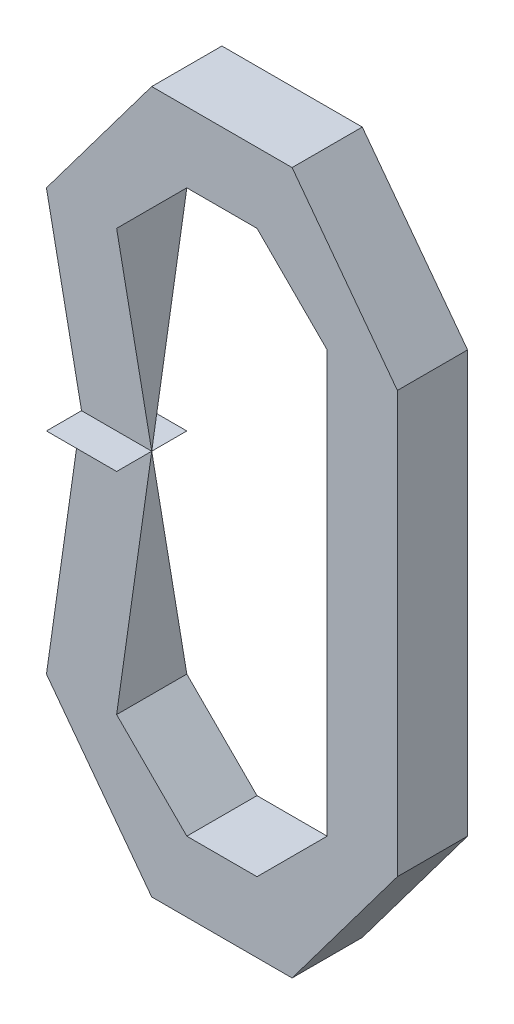
ISO-10303-21;
HEADER;
FILE_DESCRIPTION(('STEP AP214'),'2;1');
FILE_NAME('part.step','',(''),(''),'','','');
FILE_SCHEMA(('AUTOMOTIVE_DESIGN { 1 0 10303 214 1 1 1 1 }'));
ENDSEC;
DATA;
#1=APPLICATION_CONTEXT('core data for automotive mechanical design processes');
#2=APPLICATION_PROTOCOL_DEFINITION('international standard','automotive_design',2000,#1);
#3=PRODUCT_CONTEXT('',#1,'mechanical');
#4=PRODUCT('Part','Part','',(#3));
#5=PRODUCT_RELATED_PRODUCT_CATEGORY('part','',(#4));
#6=PRODUCT_DEFINITION_FORMATION('','',#4);
#7=PRODUCT_DEFINITION_CONTEXT('part definition',#1,'design');
#8=PRODUCT_DEFINITION('design','',#6,#7);
#9=PRODUCT_DEFINITION_SHAPE('','',#8);
#10=(LENGTH_UNIT() NAMED_UNIT(*) SI_UNIT(.MILLI.,.METRE.));
#11=(NAMED_UNIT(*) PLANE_ANGLE_UNIT() SI_UNIT($,.RADIAN.));
#12=(NAMED_UNIT(*) SI_UNIT($,.STERADIAN.) SOLID_ANGLE_UNIT());
#13=UNCERTAINTY_MEASURE_WITH_UNIT(LENGTH_MEASURE(1.E-05),#10,'distance_accuracy_value','');
#14=(GEOMETRIC_REPRESENTATION_CONTEXT(3) GLOBAL_UNCERTAINTY_ASSIGNED_CONTEXT((#13)) GLOBAL_UNIT_ASSIGNED_CONTEXT((#10,
#11,#12)) REPRESENTATION_CONTEXT('',''));
#15=CARTESIAN_POINT('',(0.,0.,0.));
#16=DIRECTION('',(0.,0.,1.));
#17=DIRECTION('',(1.,0.,0.));
#18=AXIS2_PLACEMENT_3D('',#15,#16,#17);
#19=CARTESIAN_POINT('',(-0.0381,0.,0.0254));
#20=DIRECTION('',(0.,0.,1.));
#21=DIRECTION('',(1.,0.,0.));
#22=AXIS2_PLACEMENT_3D('',#19,#20,#21);
#23=PLANE('',#22);
#24=DIRECTION('',(-0.6,-0.8,0.));
#25=VECTOR('',#24,1.);
#26=CARTESIAN_POINT('',(-0.06349999999999,0.0762,0.0254));
#27=LINE('',#26,#25);
#28=CARTESIAN_POINT('',(-0.06349999999999,0.0762,0.0254));
#29=VERTEX_POINT('',#28);
#30=CARTESIAN_POINT('',(-0.02539999999999,0.127,0.0254));
#31=VERTEX_POINT('',#30);
#32=EDGE_CURVE('P0_E215',#29,#31,#27,.F.);
#33=ORIENTED_EDGE('',*,*,#32,.F.);
#34=DIRECTION('',(0.,1.,0.));
#35=VECTOR('',#34,1.);
#36=CARTESIAN_POINT('',(-0.06349999999999,0.,0.0254));
#37=LINE('',#36,#35);
#38=CARTESIAN_POINT('',(-0.06349999999999,0.,0.0127));
#39=VERTEX_POINT('',#38);
#40=EDGE_CURVE('P0_E210',#39,#29,#37,.T.);
#41=ORIENTED_EDGE('',*,*,#40,.F.);
#42=DIRECTION('',(0.,1.,0.));
#43=VECTOR('',#42,1.);
#44=CARTESIAN_POINT('',(-0.06349999999999,-0.0762,0.0254));
#45=LINE('',#44,#43);
#46=CARTESIAN_POINT('',(-0.06349999999999,-0.0762,0.0254));
#47=VERTEX_POINT('',#46);
#48=EDGE_CURVE('P0_E235',#47,#39,#45,.T.);
#49=ORIENTED_EDGE('',*,*,#48,.F.);
#50=DIRECTION('',(0.6,-0.8,0.));
#51=VECTOR('',#50,1.);
#52=CARTESIAN_POINT('',(-0.02539999999999,-0.127,0.0254));
#53=LINE('',#52,#51);
#54=CARTESIAN_POINT('',(-0.02539999999999,-0.127,0.0254));
#55=VERTEX_POINT('',#54);
#56=EDGE_CURVE('P0_E233',#55,#47,#53,.F.);
#57=ORIENTED_EDGE('',*,*,#56,.F.);
#58=DIRECTION('',(1.,0.,0.));
#59=VECTOR('',#58,1.);
#60=CARTESIAN_POINT('',(0.0254,-0.127,0.0254));
#61=LINE('',#60,#59);
#62=CARTESIAN_POINT('',(0.0254,-0.127,0.0254));
#63=VERTEX_POINT('',#62);
#64=EDGE_CURVE('P0_E230',#63,#55,#61,.F.);
#65=ORIENTED_EDGE('',*,*,#64,.F.);
#66=DIRECTION('',(0.6,0.8,0.));
#67=VECTOR('',#66,1.);
#68=CARTESIAN_POINT('',(0.0635,-0.0762,0.0254));
#69=LINE('',#68,#67);
#70=CARTESIAN_POINT('',(0.0635,-0.0762,0.0254));
#71=VERTEX_POINT('',#70);
#72=EDGE_CURVE('P0_E227',#71,#63,#69,.F.);
#73=ORIENTED_EDGE('',*,*,#72,.F.);
#74=DIRECTION('',(0.,1.,0.));
#75=VECTOR('',#74,1.);
#76=CARTESIAN_POINT('',(0.0635,0.0762,0.0254));
#77=LINE('',#76,#75);
#78=CARTESIAN_POINT('',(0.0635,0.0762,0.0254));
#79=VERTEX_POINT('',#78);
#80=EDGE_CURVE('P0_E224',#79,#71,#77,.F.);
#81=ORIENTED_EDGE('',*,*,#80,.F.);
#82=DIRECTION('',(-0.6,0.8,0.));
#83=VECTOR('',#82,1.);
#84=CARTESIAN_POINT('',(0.0254,0.127,0.0254));
#85=LINE('',#84,#83);
#86=CARTESIAN_POINT('',(0.0254,0.127,0.0254));
#87=VERTEX_POINT('',#86);
#88=EDGE_CURVE('P0_E221',#87,#79,#85,.F.);
#89=ORIENTED_EDGE('',*,*,#88,.F.);
#90=DIRECTION('',(1.,0.,0.));
#91=VECTOR('',#90,1.);
#92=CARTESIAN_POINT('',(-0.02539999999999,0.127,0.0254));
#93=LINE('',#92,#91);
#94=EDGE_CURVE('P0_E218',#31,#87,#93,.T.);
#95=ORIENTED_EDGE('',*,*,#94,.F.);
#96=EDGE_LOOP('',(#33,#41,#49,#57,#65,#73,#81,#89,#95));
#97=FACE_BOUND('',#96,.T.);
#98=DIRECTION('',(-0.707106781186548,0.707106781186547,0.));
#99=VECTOR('',#98,1.);
#100=CARTESIAN_POINT('',(-0.0127,-0.1016,0.0254));
#101=LINE('',#100,#99);
#102=CARTESIAN_POINT('',(-0.0127,-0.1016,0.0254));
#103=VERTEX_POINT('',#102);
#104=CARTESIAN_POINT('',(-0.0381,-0.0762,0.0254));
#105=VERTEX_POINT('',#104);
#106=EDGE_CURVE('P0_E244',#103,#105,#101,.T.);
#107=ORIENTED_EDGE('',*,*,#106,.T.);
#108=DIRECTION('',(0.,1.,0.));
#109=VECTOR('',#108,1.);
#110=CARTESIAN_POINT('',(-0.0381,0.,0.0254));
#111=LINE('',#110,#109);
#112=CARTESIAN_POINT('',(-0.0381,0.,0.0127));
#113=VERTEX_POINT('',#112);
#114=EDGE_CURVE('P0_E136',#105,#113,#111,.T.);
#115=ORIENTED_EDGE('',*,*,#114,.T.);
#116=DIRECTION('',(0.,1.,0.));
#117=VECTOR('',#116,1.);
#118=CARTESIAN_POINT('',(-0.0381,0.,0.0254));
#119=LINE('',#118,#117);
#120=CARTESIAN_POINT('',(-0.0381,0.0762,0.0254));
#121=VERTEX_POINT('',#120);
#122=EDGE_CURVE('P0_E134',#113,#121,#119,.T.);
#123=ORIENTED_EDGE('',*,*,#122,.T.);
#124=DIRECTION('',(0.707106781186548,0.707106781186547,0.));
#125=VECTOR('',#124,1.);
#126=CARTESIAN_POINT('',(-0.0381,0.0762,0.0254));
#127=LINE('',#126,#125);
#128=CARTESIAN_POINT('',(-0.0127,0.1016,0.0254));
#129=VERTEX_POINT('',#128);
#130=EDGE_CURVE('P0_E130',#121,#129,#127,.T.);
#131=ORIENTED_EDGE('',*,*,#130,.T.);
#132=DIRECTION('',(1.,0.,0.));
#133=VECTOR('',#132,1.);
#134=CARTESIAN_POINT('',(-0.0381,0.1016,0.0254));
#135=LINE('',#134,#133);
#136=CARTESIAN_POINT('',(0.01270000000001,0.1016,0.0254));
#137=VERTEX_POINT('',#136);
#138=EDGE_CURVE('P0_E259',#129,#137,#135,.T.);
#139=ORIENTED_EDGE('',*,*,#138,.T.);
#140=DIRECTION('',(0.707106781186408,-0.707106781186687,0.));
#141=VECTOR('',#140,1.);
#142=CARTESIAN_POINT('',(0.01270000000001,0.1016,0.0254));
#143=LINE('',#142,#141);
#144=CARTESIAN_POINT('',(0.0381,0.0762,0.0254));
#145=VERTEX_POINT('',#144);
#146=EDGE_CURVE('P0_E256',#137,#145,#143,.T.);
#147=ORIENTED_EDGE('',*,*,#146,.T.);
#148=DIRECTION('',(0.,1.,0.));
#149=VECTOR('',#148,1.);
#150=CARTESIAN_POINT('',(0.0381,0.,0.0254));
#151=LINE('',#150,#149);
#152=CARTESIAN_POINT('',(0.0381,-0.0762,0.0254));
#153=VERTEX_POINT('',#152);
#154=EDGE_CURVE('P0_E253',#145,#153,#151,.F.);
#155=ORIENTED_EDGE('',*,*,#154,.T.);
#156=DIRECTION('',(-0.707106781186408,-0.707106781186687,0.));
#157=VECTOR('',#156,1.);
#158=CARTESIAN_POINT('',(0.0381,-0.0762,0.0254));
#159=LINE('',#158,#157);
#160=CARTESIAN_POINT('',(0.01270000000001,-0.1016,0.0254));
#161=VERTEX_POINT('',#160);
#162=EDGE_CURVE('P0_E250',#153,#161,#159,.T.);
#163=ORIENTED_EDGE('',*,*,#162,.T.);
#164=DIRECTION('',(1.,0.,0.));
#165=VECTOR('',#164,1.);
#166=CARTESIAN_POINT('',(-0.0381,-0.1016,0.0254));
#167=LINE('',#166,#165);
#168=EDGE_CURVE('P0_E247',#161,#103,#167,.F.);
#169=ORIENTED_EDGE('',*,*,#168,.T.);
#170=EDGE_LOOP('',(#107,#115,#123,#131,#139,#147,#155,#163,#169));
#171=FACE_BOUND('',#170,.T.);
#172=ADVANCED_FACE('P0_F17',(#97,#171),#23,.T.);
#173=CARTESIAN_POINT('',(-0.0381,0.,0.));
#174=DIRECTION('',(-1.,0.,0.));
#175=DIRECTION('',(0.,0.,1.));
#176=AXIS2_PLACEMENT_3D('',#173,#174,#175);
#177=PLANE('',#176);
#178=DIRECTION('',(0.,0.,1.));
#179=VECTOR('',#178,1.);
#180=CARTESIAN_POINT('',(-0.0381,0.0762,0.));
#181=LINE('',#180,#179);
#182=CARTESIAN_POINT('',(-0.0381,0.0762,0.));
#183=VERTEX_POINT('',#182);
#184=EDGE_CURVE('P0_E141',#183,#121,#181,.T.);
#185=ORIENTED_EDGE('',*,*,#184,.T.);
#186=ORIENTED_EDGE('',*,*,#122,.F.);
#187=DIRECTION('',(0.,1.,0.));
#188=VECTOR('',#187,1.);
#189=CARTESIAN_POINT('',(-0.0381,0.,0.));
#190=LINE('',#189,#188);
#191=EDGE_CURVE('P0_E150',#113,#183,#190,.T.);
#192=ORIENTED_EDGE('',*,*,#191,.T.);
#193=EDGE_LOOP('',(#185,#186,#192));
#194=FACE_BOUND('',#193,.T.);
#195=ADVANCED_FACE('P0_F149',(#194),#177,.F.);
#196=CARTESIAN_POINT('',(-0.0381,0.0762,0.));
#197=DIRECTION('',(-0.707106781187048,0.707106781186048,0.));
#198=DIRECTION('',(-0.707106781186048,-0.707106781187048,0.));
#199=AXIS2_PLACEMENT_3D('',#196,#197,#198);
#200=PLANE('',#199);
#201=DIRECTION('',(0.,0.,1.));
#202=VECTOR('',#201,1.);
#203=CARTESIAN_POINT('',(-0.0127,0.1016,0.));
#204=LINE('',#203,#202);
#205=CARTESIAN_POINT('',(-0.012700000000018,0.1016,0.));
#206=VERTEX_POINT('',#205);
#207=EDGE_CURVE('P0_E147',#206,#129,#204,.T.);
#208=ORIENTED_EDGE('',*,*,#207,.T.);
#209=ORIENTED_EDGE('',*,*,#130,.F.);
#210=ORIENTED_EDGE('',*,*,#184,.F.);
#211=DIRECTION('',(-0.707106781186048,-0.707106781187048,0.));
#212=VECTOR('',#211,1.);
#213=CARTESIAN_POINT('',(-0.0381,0.0762,0.));
#214=LINE('',#213,#212);
#215=EDGE_CURVE('P0_E205',#183,#206,#214,.F.);
#216=ORIENTED_EDGE('',*,*,#215,.T.);
#217=EDGE_LOOP('',(#208,#209,#210,#216));
#218=FACE_BOUND('',#217,.T.);
#219=ADVANCED_FACE('P0_F144',(#218),#200,.F.);
#220=CARTESIAN_POINT('',(-0.0127,0.1016,0.));
#221=DIRECTION('',(0.,1.,0.));
#222=DIRECTION('',(0.,0.,1.));
#223=AXIS2_PLACEMENT_3D('',#220,#221,#222);
#224=PLANE('',#223);
#225=DIRECTION('',(0.,0.,1.));
#226=VECTOR('',#225,1.);
#227=CARTESIAN_POINT('',(0.01270000000001,0.1016,0.));
#228=LINE('',#227,#226);
#229=CARTESIAN_POINT('',(0.01270000000001,0.1016,0.));
#230=VERTEX_POINT('',#229);
#231=EDGE_CURVE('P0_E258',#230,#137,#228,.T.);
#232=ORIENTED_EDGE('',*,*,#231,.T.);
#233=ORIENTED_EDGE('',*,*,#138,.F.);
#234=ORIENTED_EDGE('',*,*,#207,.F.);
#235=DIRECTION('',(1.,0.,0.));
#236=VECTOR('',#235,1.);
#237=CARTESIAN_POINT('',(-0.0127,0.1016,0.));
#238=LINE('',#237,#236);
#239=EDGE_CURVE('P0_E202',#206,#230,#238,.T.);
#240=ORIENTED_EDGE('',*,*,#239,.T.);
#241=EDGE_LOOP('',(#232,#233,#234,#240));
#242=FACE_BOUND('',#241,.T.);
#243=ADVANCED_FACE('P0_F373',(#242),#224,.F.);
#244=CARTESIAN_POINT('',(0.01270000000001,0.1016,0.));
#245=DIRECTION('',(0.707106781187048,0.707106781186048,0.));
#246=DIRECTION('',(-0.707106781186048,0.707106781187048,0.));
#247=AXIS2_PLACEMENT_3D('',#244,#245,#246);
#248=PLANE('',#247);
#249=DIRECTION('',(0.,0.,-1.));
#250=VECTOR('',#249,1.);
#251=CARTESIAN_POINT('',(0.0381,0.0762,0.));
#252=LINE('',#251,#250);
#253=CARTESIAN_POINT('',(0.0381,0.076199999999987,0.));
#254=VERTEX_POINT('',#253);
#255=EDGE_CURVE('P0_E255',#254,#145,#252,.F.);
#256=ORIENTED_EDGE('',*,*,#255,.T.);
#257=ORIENTED_EDGE('',*,*,#146,.F.);
#258=ORIENTED_EDGE('',*,*,#231,.F.);
#259=DIRECTION('',(-0.707106781186048,0.707106781187048,0.));
#260=VECTOR('',#259,1.);
#261=CARTESIAN_POINT('',(0.01270000000001,0.1016,0.));
#262=LINE('',#261,#260);
#263=EDGE_CURVE('P0_E199',#230,#254,#262,.F.);
#264=ORIENTED_EDGE('',*,*,#263,.T.);
#265=EDGE_LOOP('',(#256,#257,#258,#264));
#266=FACE_BOUND('',#265,.T.);
#267=ADVANCED_FACE('P0_F369',(#266),#248,.F.);
#268=CARTESIAN_POINT('',(0.0381,0.0762,0.));
#269=DIRECTION('',(1.,0.,0.));
#270=DIRECTION('',(0.,0.,-1.));
#271=AXIS2_PLACEMENT_3D('',#268,#269,#270);
#272=PLANE('',#271);
#273=DIRECTION('',(0.,0.,1.));
#274=VECTOR('',#273,1.);
#275=CARTESIAN_POINT('',(0.0381,-0.0762,0.));
#276=LINE('',#275,#274);
#277=CARTESIAN_POINT('',(0.0381,-0.0762,0.));
#278=VERTEX_POINT('',#277);
#279=EDGE_CURVE('P0_E252',#278,#153,#276,.T.);
#280=ORIENTED_EDGE('',*,*,#279,.T.);
#281=ORIENTED_EDGE('',*,*,#154,.F.);
#282=ORIENTED_EDGE('',*,*,#255,.F.);
#283=DIRECTION('',(0.,1.,0.));
#284=VECTOR('',#283,1.);
#285=CARTESIAN_POINT('',(0.0381,0.0762,0.));
#286=LINE('',#285,#284);
#287=EDGE_CURVE('P0_E196',#254,#278,#286,.F.);
#288=ORIENTED_EDGE('',*,*,#287,.T.);
#289=EDGE_LOOP('',(#280,#281,#282,#288));
#290=FACE_BOUND('',#289,.T.);
#291=ADVANCED_FACE('P0_F365',(#290),#272,.F.);
#292=CARTESIAN_POINT('',(0.0381,-0.0762,0.));
#293=DIRECTION('',(0.707106781186548,-0.707106781186548,0.));
#294=DIRECTION('',(0.707106781186548,0.707106781186548,0.));
#295=AXIS2_PLACEMENT_3D('',#292,#293,#294);
#296=PLANE('',#295);
#297=DIRECTION('',(0.,0.,-1.));
#298=VECTOR('',#297,1.);
#299=CARTESIAN_POINT('',(0.01270000000001,-0.1016,0.));
#300=LINE('',#299,#298);
#301=CARTESIAN_POINT('',(0.012700000000005,-0.1016,0.));
#302=VERTEX_POINT('',#301);
#303=EDGE_CURVE('P0_E249',#302,#161,#300,.F.);
#304=ORIENTED_EDGE('',*,*,#303,.T.);
#305=ORIENTED_EDGE('',*,*,#162,.F.);
#306=ORIENTED_EDGE('',*,*,#279,.F.);
#307=DIRECTION('',(0.707106781186548,0.707106781186548,0.));
#308=VECTOR('',#307,1.);
#309=CARTESIAN_POINT('',(0.0381,-0.0762,0.));
#310=LINE('',#309,#308);
#311=EDGE_CURVE('P0_E193',#278,#302,#310,.F.);
#312=ORIENTED_EDGE('',*,*,#311,.T.);
#313=EDGE_LOOP('',(#304,#305,#306,#312));
#314=FACE_BOUND('',#313,.T.);
#315=ADVANCED_FACE('P0_F361',(#314),#296,.F.);
#316=CARTESIAN_POINT('',(0.01270000000001,-0.1016,0.));
#317=DIRECTION('',(0.,-1.,0.));
#318=DIRECTION('',(0.,0.,-1.));
#319=AXIS2_PLACEMENT_3D('',#316,#317,#318);
#320=PLANE('',#319);
#321=DIRECTION('',(0.,0.,1.));
#322=VECTOR('',#321,1.);
#323=CARTESIAN_POINT('',(-0.0127,-0.1016,0.));
#324=LINE('',#323,#322);
#325=CARTESIAN_POINT('',(-0.0127,-0.1016,0.));
#326=VERTEX_POINT('',#325);
#327=EDGE_CURVE('P0_E246',#326,#103,#324,.T.);
#328=ORIENTED_EDGE('',*,*,#327,.T.);
#329=ORIENTED_EDGE('',*,*,#168,.F.);
#330=ORIENTED_EDGE('',*,*,#303,.F.);
#331=DIRECTION('',(1.,0.,0.));
#332=VECTOR('',#331,1.);
#333=CARTESIAN_POINT('',(0.01270000000001,-0.1016,0.));
#334=LINE('',#333,#332);
#335=EDGE_CURVE('P0_E190',#302,#326,#334,.F.);
#336=ORIENTED_EDGE('',*,*,#335,.T.);
#337=EDGE_LOOP('',(#328,#329,#330,#336));
#338=FACE_BOUND('',#337,.T.);
#339=ADVANCED_FACE('P0_F357',(#338),#320,.F.);
#340=CARTESIAN_POINT('',(-0.0127,-0.1016,0.));
#341=DIRECTION('',(-0.707106781186048,-0.707106781187048,0.));
#342=DIRECTION('',(0.707106781187048,-0.707106781186048,0.));
#343=AXIS2_PLACEMENT_3D('',#340,#341,#342);
#344=PLANE('',#343);
#345=DIRECTION('',(0.,0.,1.));
#346=VECTOR('',#345,1.);
#347=CARTESIAN_POINT('',(-0.0381,-0.0762,0.));
#348=LINE('',#347,#346);
#349=CARTESIAN_POINT('',(-0.0381,-0.076200000000018,0.));
#350=VERTEX_POINT('',#349);
#351=EDGE_CURVE('P0_E241',#350,#105,#348,.T.);
#352=ORIENTED_EDGE('',*,*,#351,.T.);
#353=ORIENTED_EDGE('',*,*,#106,.F.);
#354=ORIENTED_EDGE('',*,*,#327,.F.);
#355=DIRECTION('',(0.707106781187048,-0.707106781186048,0.));
#356=VECTOR('',#355,1.);
#357=CARTESIAN_POINT('',(-0.0127,-0.1016,0.));
#358=LINE('',#357,#356);
#359=EDGE_CURVE('P0_E185',#326,#350,#358,.F.);
#360=ORIENTED_EDGE('',*,*,#359,.T.);
#361=EDGE_LOOP('',(#352,#353,#354,#360));
#362=FACE_BOUND('',#361,.T.);
#363=ADVANCED_FACE('P0_F353',(#362),#344,.F.);
#364=CARTESIAN_POINT('',(-0.0381,-0.0762,0.));
#365=DIRECTION('',(-1.,0.,0.));
#366=DIRECTION('',(0.,0.,1.));
#367=AXIS2_PLACEMENT_3D('',#364,#365,#366);
#368=PLANE('',#367);
#369=ORIENTED_EDGE('',*,*,#114,.F.);
#370=ORIENTED_EDGE('',*,*,#351,.F.);
#371=DIRECTION('',(0.,1.,0.));
#372=VECTOR('',#371,1.);
#373=CARTESIAN_POINT('',(-0.0381,-0.0762,0.));
#374=LINE('',#373,#372);
#375=EDGE_CURVE('P0_E180',#350,#113,#374,.T.);
#376=ORIENTED_EDGE('',*,*,#375,.T.);
#377=EDGE_LOOP('',(#369,#370,#376));
#378=FACE_BOUND('',#377,.T.);
#379=ADVANCED_FACE('P0_F350',(#378),#368,.F.);
#380=CARTESIAN_POINT('',(-0.06349999999999,-0.0762,0.));
#381=DIRECTION('',(-1.,0.,0.));
#382=DIRECTION('',(0.,0.,1.));
#383=AXIS2_PLACEMENT_3D('',#380,#381,#382);
#384=PLANE('',#383);
#385=DIRECTION('',(0.,1.,0.));
#386=VECTOR('',#385,1.);
#387=CARTESIAN_POINT('',(-0.06349999999999,-0.0762,0.));
#388=LINE('',#387,#386);
#389=CARTESIAN_POINT('',(-0.06349999999999,-0.0762,0.));
#390=VERTEX_POINT('',#389);
#391=EDGE_CURVE('P0_E177',#39,#390,#388,.F.);
#392=ORIENTED_EDGE('',*,*,#391,.T.);
#393=DIRECTION('',(0.,0.,1.));
#394=VECTOR('',#393,1.);
#395=CARTESIAN_POINT('',(-0.06349999999999,-0.0762,0.));
#396=LINE('',#395,#394);
#397=EDGE_CURVE('P0_E232',#47,#390,#396,.F.);
#398=ORIENTED_EDGE('',*,*,#397,.F.);
#399=ORIENTED_EDGE('',*,*,#48,.T.);
#400=EDGE_LOOP('',(#392,#398,#399));
#401=FACE_BOUND('',#400,.T.);
#402=ADVANCED_FACE('P0_F322',(#401),#384,.T.);
#403=CARTESIAN_POINT('',(-0.02539999999999,-0.127,0.));
#404=DIRECTION('',(-0.8,-0.6,0.));
#405=DIRECTION('',(0.6,-0.8,0.));
#406=AXIS2_PLACEMENT_3D('',#403,#404,#405);
#407=PLANE('',#406);
#408=ORIENTED_EDGE('',*,*,#397,.T.);
#409=DIRECTION('',(0.6,-0.8,0.));
#410=VECTOR('',#409,1.);
#411=CARTESIAN_POINT('',(-0.02539999999999,-0.127,0.));
#412=LINE('',#411,#410);
#413=CARTESIAN_POINT('',(-0.02539999999999,-0.127,0.));
#414=VERTEX_POINT('',#413);
#415=EDGE_CURVE('P0_E174',#390,#414,#412,.T.);
#416=ORIENTED_EDGE('',*,*,#415,.T.);
#417=DIRECTION('',(0.,0.,-1.));
#418=VECTOR('',#417,1.);
#419=CARTESIAN_POINT('',(-0.02539999999999,-0.127,0.));
#420=LINE('',#419,#418);
#421=EDGE_CURVE('P0_E229',#55,#414,#420,.T.);
#422=ORIENTED_EDGE('',*,*,#421,.F.);
#423=ORIENTED_EDGE('',*,*,#56,.T.);
#424=EDGE_LOOP('',(#408,#416,#422,#423));
#425=FACE_BOUND('',#424,.T.);
#426=ADVANCED_FACE('P0_F318',(#425),#407,.T.);
#427=CARTESIAN_POINT('',(0.0254,-0.127,0.));
#428=DIRECTION('',(0.,-1.,0.));
#429=DIRECTION('',(0.,0.,-1.));
#430=AXIS2_PLACEMENT_3D('',#427,#428,#429);
#431=PLANE('',#430);
#432=ORIENTED_EDGE('',*,*,#421,.T.);
#433=DIRECTION('',(1.,0.,0.));
#434=VECTOR('',#433,1.);
#435=CARTESIAN_POINT('',(0.0254,-0.127,0.));
#436=LINE('',#435,#434);
#437=CARTESIAN_POINT('',(0.0254,-0.127,0.));
#438=VERTEX_POINT('',#437);
#439=EDGE_CURVE('P0_E171',#414,#438,#436,.T.);
#440=ORIENTED_EDGE('',*,*,#439,.T.);
#441=DIRECTION('',(0.,0.,1.));
#442=VECTOR('',#441,1.);
#443=CARTESIAN_POINT('',(0.0254,-0.127,0.));
#444=LINE('',#443,#442);
#445=EDGE_CURVE('P0_E226',#63,#438,#444,.F.);
#446=ORIENTED_EDGE('',*,*,#445,.F.);
#447=ORIENTED_EDGE('',*,*,#64,.T.);
#448=EDGE_LOOP('',(#432,#440,#446,#447));
#449=FACE_BOUND('',#448,.T.);
#450=ADVANCED_FACE('P0_F314',(#449),#431,.T.);
#451=CARTESIAN_POINT('',(0.0635,-0.0762,0.));
#452=DIRECTION('',(0.8,-0.6,0.));
#453=DIRECTION('',(0.6,0.8,0.));
#454=AXIS2_PLACEMENT_3D('',#451,#452,#453);
#455=PLANE('',#454);
#456=ORIENTED_EDGE('',*,*,#445,.T.);
#457=DIRECTION('',(0.6,0.8,0.));
#458=VECTOR('',#457,1.);
#459=CARTESIAN_POINT('',(0.0635,-0.0762,0.));
#460=LINE('',#459,#458);
#461=CARTESIAN_POINT('',(0.0635,-0.0762,0.));
#462=VERTEX_POINT('',#461);
#463=EDGE_CURVE('P0_E168',#438,#462,#460,.T.);
#464=ORIENTED_EDGE('',*,*,#463,.T.);
#465=DIRECTION('',(0.,0.,-1.));
#466=VECTOR('',#465,1.);
#467=CARTESIAN_POINT('',(0.0635,-0.0762,0.));
#468=LINE('',#467,#466);
#469=EDGE_CURVE('P0_E223',#71,#462,#468,.T.);
#470=ORIENTED_EDGE('',*,*,#469,.F.);
#471=ORIENTED_EDGE('',*,*,#72,.T.);
#472=EDGE_LOOP('',(#456,#464,#470,#471));
#473=FACE_BOUND('',#472,.T.);
#474=ADVANCED_FACE('P0_F308',(#473),#455,.T.);
#475=CARTESIAN_POINT('',(0.0635,0.0762,0.));
#476=DIRECTION('',(1.,0.,0.));
#477=DIRECTION('',(0.,0.,-1.));
#478=AXIS2_PLACEMENT_3D('',#475,#476,#477);
#479=PLANE('',#478);
#480=ORIENTED_EDGE('',*,*,#469,.T.);
#481=DIRECTION('',(0.,1.,0.));
#482=VECTOR('',#481,1.);
#483=CARTESIAN_POINT('',(0.0635,0.0762,0.));
#484=LINE('',#483,#482);
#485=CARTESIAN_POINT('',(0.0635,0.0762,0.));
#486=VERTEX_POINT('',#485);
#487=EDGE_CURVE('P0_E165',#462,#486,#484,.T.);
#488=ORIENTED_EDGE('',*,*,#487,.T.);
#489=DIRECTION('',(0.,0.,1.));
#490=VECTOR('',#489,1.);
#491=CARTESIAN_POINT('',(0.0635,0.0762,0.));
#492=LINE('',#491,#490);
#493=EDGE_CURVE('P0_E220',#79,#486,#492,.F.);
#494=ORIENTED_EDGE('',*,*,#493,.F.);
#495=ORIENTED_EDGE('',*,*,#80,.T.);
#496=EDGE_LOOP('',(#480,#488,#494,#495));
#497=FACE_BOUND('',#496,.T.);
#498=ADVANCED_FACE('P0_F304',(#497),#479,.T.);
#499=CARTESIAN_POINT('',(0.0254,0.127,0.));
#500=DIRECTION('',(0.8,0.6,0.));
#501=DIRECTION('',(-0.6,0.8,0.));
#502=AXIS2_PLACEMENT_3D('',#499,#500,#501);
#503=PLANE('',#502);
#504=ORIENTED_EDGE('',*,*,#493,.T.);
#505=DIRECTION('',(-0.6,0.8,0.));
#506=VECTOR('',#505,1.);
#507=CARTESIAN_POINT('',(0.0254,0.127,0.));
#508=LINE('',#507,#506);
#509=CARTESIAN_POINT('',(0.0254,0.127,0.));
#510=VERTEX_POINT('',#509);
#511=EDGE_CURVE('P0_E162',#486,#510,#508,.T.);
#512=ORIENTED_EDGE('',*,*,#511,.T.);
#513=DIRECTION('',(0.,0.,1.));
#514=VECTOR('',#513,1.);
#515=CARTESIAN_POINT('',(0.0254,0.127,0.));
#516=LINE('',#515,#514);
#517=EDGE_CURVE('P0_E217',#87,#510,#516,.F.);
#518=ORIENTED_EDGE('',*,*,#517,.F.);
#519=ORIENTED_EDGE('',*,*,#88,.T.);
#520=EDGE_LOOP('',(#504,#512,#518,#519));
#521=FACE_BOUND('',#520,.T.);
#522=ADVANCED_FACE('P0_F298',(#521),#503,.T.);
#523=CARTESIAN_POINT('',(-0.02539999999999,0.127,0.));
#524=DIRECTION('',(0.,1.,0.));
#525=DIRECTION('',(0.,0.,1.));
#526=AXIS2_PLACEMENT_3D('',#523,#524,#525);
#527=PLANE('',#526);
#528=ORIENTED_EDGE('',*,*,#517,.T.);
#529=DIRECTION('',(1.,0.,0.));
#530=VECTOR('',#529,1.);
#531=CARTESIAN_POINT('',(-0.02539999999999,0.127,0.));
#532=LINE('',#531,#530);
#533=CARTESIAN_POINT('',(-0.02539999999999,0.127,0.));
#534=VERTEX_POINT('',#533);
#535=EDGE_CURVE('P0_E159',#510,#534,#532,.F.);
#536=ORIENTED_EDGE('',*,*,#535,.T.);
#537=DIRECTION('',(0.,0.,1.));
#538=VECTOR('',#537,1.);
#539=CARTESIAN_POINT('',(-0.02539999999999,0.127,0.));
#540=LINE('',#539,#538);
#541=EDGE_CURVE('P0_E212',#31,#534,#540,.F.);
#542=ORIENTED_EDGE('',*,*,#541,.F.);
#543=ORIENTED_EDGE('',*,*,#94,.T.);
#544=EDGE_LOOP('',(#528,#536,#542,#543));
#545=FACE_BOUND('',#544,.T.);
#546=ADVANCED_FACE('P0_F294',(#545),#527,.T.);
#547=CARTESIAN_POINT('',(-0.06349999999999,0.0762,0.));
#548=DIRECTION('',(-0.8,0.6,0.));
#549=DIRECTION('',(-0.6,-0.8,0.));
#550=AXIS2_PLACEMENT_3D('',#547,#548,#549);
#551=PLANE('',#550);
#552=ORIENTED_EDGE('',*,*,#541,.T.);
#553=DIRECTION('',(-0.6,-0.8,0.));
#554=VECTOR('',#553,1.);
#555=CARTESIAN_POINT('',(-0.06349999999999,0.0762,0.));
#556=LINE('',#555,#554);
#557=CARTESIAN_POINT('',(-0.06349999999999,0.0762,0.));
#558=VERTEX_POINT('',#557);
#559=EDGE_CURVE('P0_E26',#534,#558,#556,.T.);
#560=ORIENTED_EDGE('',*,*,#559,.T.);
#561=DIRECTION('',(0.,0.,1.));
#562=VECTOR('',#561,1.);
#563=CARTESIAN_POINT('',(-0.06349999999999,0.0762,0.));
#564=LINE('',#563,#562);
#565=EDGE_CURVE('P0_E34',#29,#558,#564,.F.);
#566=ORIENTED_EDGE('',*,*,#565,.F.);
#567=ORIENTED_EDGE('',*,*,#32,.T.);
#568=EDGE_LOOP('',(#552,#560,#566,#567));
#569=FACE_BOUND('',#568,.T.);
#570=ADVANCED_FACE('P0_F284',(#569),#551,.T.);
#571=CARTESIAN_POINT('',(-0.06349999999999,0.,0.));
#572=DIRECTION('',(-1.,0.,0.));
#573=DIRECTION('',(0.,0.,1.));
#574=AXIS2_PLACEMENT_3D('',#571,#572,#573);
#575=PLANE('',#574);
#576=ORIENTED_EDGE('',*,*,#565,.T.);
#577=DIRECTION('',(0.,1.,0.));
#578=VECTOR('',#577,1.);
#579=CARTESIAN_POINT('',(-0.06349999999999,0.,0.));
#580=LINE('',#579,#578);
#581=EDGE_CURVE('P0_E11',#558,#39,#580,.F.);
#582=ORIENTED_EDGE('',*,*,#581,.T.);
#583=ORIENTED_EDGE('',*,*,#40,.T.);
#584=EDGE_LOOP('',(#576,#582,#583));
#585=FACE_BOUND('',#584,.T.);
#586=ADVANCED_FACE('P0_F325',(#585),#575,.T.);
#587=CARTESIAN_POINT('',(-0.0381,0.,0.));
#588=DIRECTION('',(0.,0.,1.));
#589=DIRECTION('',(1.,0.,0.));
#590=AXIS2_PLACEMENT_3D('',#587,#588,#589);
#591=PLANE('',#590);
#592=ORIENTED_EDGE('',*,*,#559,.F.);
#593=ORIENTED_EDGE('',*,*,#535,.F.);
#594=ORIENTED_EDGE('',*,*,#511,.F.);
#595=ORIENTED_EDGE('',*,*,#487,.F.);
#596=ORIENTED_EDGE('',*,*,#463,.F.);
#597=ORIENTED_EDGE('',*,*,#439,.F.);
#598=ORIENTED_EDGE('',*,*,#415,.F.);
#599=ORIENTED_EDGE('',*,*,#391,.F.);
#600=ORIENTED_EDGE('',*,*,#581,.F.);
#601=EDGE_LOOP('',(#592,#593,#594,#595,#596,#597,#598,#599,#600));
#602=FACE_BOUND('',#601,.T.);
#603=ORIENTED_EDGE('',*,*,#359,.F.);
#604=ORIENTED_EDGE('',*,*,#335,.F.);
#605=ORIENTED_EDGE('',*,*,#311,.F.);
#606=ORIENTED_EDGE('',*,*,#287,.F.);
#607=ORIENTED_EDGE('',*,*,#263,.F.);
#608=ORIENTED_EDGE('',*,*,#239,.F.);
#609=ORIENTED_EDGE('',*,*,#215,.F.);
#610=ORIENTED_EDGE('',*,*,#191,.F.);
#611=ORIENTED_EDGE('',*,*,#375,.F.);
#612=EDGE_LOOP('',(#603,#604,#605,#606,#607,#608,#609,#610,#611));
#613=FACE_BOUND('',#612,.T.);
#614=ADVANCED_FACE('P0_F290',(#602,#613),#591,.F.);
#615=CLOSED_SHELL('',(#172,#195,#219,#243,#267,#291,#315,#339,#363,#379,#402,#426,#450,#474,
#498,#522,#546,#570,#586,#614));
#616=MANIFOLD_SOLID_BREP('P0_B1',#615);
#617=CARTESIAN_POINT('',(-0.06349999999999,0.,0.));
#618=DIRECTION('',(0.,1.,0.));
#619=DIRECTION('',(0.,0.,1.));
#620=AXIS2_PLACEMENT_3D('',#617,#618,#619);
#621=PLANE('',#620);
#622=DIRECTION('',(0.,0.,1.));
#623=VECTOR('',#622,1.);
#624=CARTESIAN_POINT('',(-0.0381,0.,0.));
#625=LINE('',#624,#623);
#626=CARTESIAN_POINT('',(-0.0381,0.,0.0254));
#627=VERTEX_POINT('',#626);
#628=CARTESIAN_POINT('',(-0.0381,0.,0.));
#629=VERTEX_POINT('',#628);
#630=EDGE_CURVE('P1_E24',#627,#629,#625,.F.);
#631=ORIENTED_EDGE('',*,*,#630,.T.);
#632=DIRECTION('',(1.,0.,0.));
#633=VECTOR('',#632,1.);
#634=CARTESIAN_POINT('',(-0.06349999999999,0.,0.));
#635=LINE('',#634,#633);
#636=CARTESIAN_POINT('',(-0.06349999999999,0.,0.));
#637=VERTEX_POINT('',#636);
#638=EDGE_CURVE('P1_E11',#629,#637,#635,.F.);
#639=ORIENTED_EDGE('',*,*,#638,.T.);
#640=DIRECTION('',(0.,0.,1.));
#641=VECTOR('',#640,1.);
#642=CARTESIAN_POINT('',(-0.06349999999999,0.,0.));
#643=LINE('',#642,#641);
#644=CARTESIAN_POINT('',(-0.06349999999999,0.,0.0254));
#645=VERTEX_POINT('',#644);
#646=EDGE_CURVE('P1_E18',#637,#645,#643,.T.);
#647=ORIENTED_EDGE('',*,*,#646,.T.);
#648=DIRECTION('',(1.,0.,0.));
#649=VECTOR('',#648,1.);
#650=CARTESIAN_POINT('',(-0.06349999999999,0.,0.0254));
#651=LINE('',#650,#649);
#652=EDGE_CURVE('P1_E38',#645,#627,#651,.T.);
#653=ORIENTED_EDGE('',*,*,#652,.T.);
#654=EDGE_LOOP('',(#631,#639,#647,#653));
#655=FACE_BOUND('',#654,.T.);
#656=ADVANCED_FACE('P1_F17',(#655),#621,.T.);
#657=OPEN_SHELL('',(#656));
#658=SHELL_BASED_SURFACE_MODEL('P1_B1',(#657));
#659=ADVANCED_BREP_SHAPE_REPRESENTATION('',(#18,#616),#14);
#660=MANIFOLD_SURFACE_SHAPE_REPRESENTATION('',(#18,#658),#14);
#661=SHAPE_REPRESENTATION('',(#18),#14);
#662=SHAPE_DEFINITION_REPRESENTATION(#9,#661);
#663=SHAPE_REPRESENTATION_RELATIONSHIP('','',#661,#659);
#664=SHAPE_REPRESENTATION_RELATIONSHIP('','',#661,#660);
ENDSEC;
END-ISO-10303-21;
